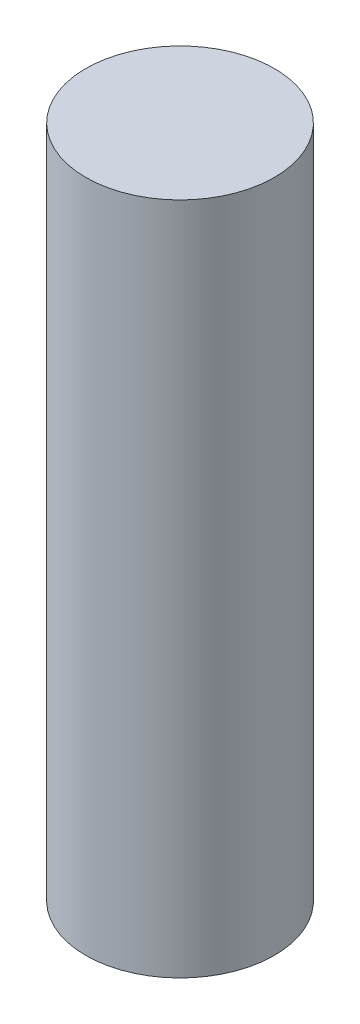
ISO-10303-21;
HEADER;
FILE_DESCRIPTION(('STEP AP214'),'2;1');
FILE_NAME('part.step','',(''),(''),'','','');
FILE_SCHEMA(('AUTOMOTIVE_DESIGN { 1 0 10303 214 1 1 1 1 }'));
ENDSEC;
DATA;
#1=APPLICATION_CONTEXT('core data for automotive mechanical design processes');
#2=APPLICATION_PROTOCOL_DEFINITION('international standard','automotive_design',2000,#1);
#3=PRODUCT_CONTEXT('',#1,'mechanical');
#4=PRODUCT('Part','Part','',(#3));
#5=PRODUCT_RELATED_PRODUCT_CATEGORY('part','',(#4));
#6=PRODUCT_DEFINITION_FORMATION('','',#4);
#7=PRODUCT_DEFINITION_CONTEXT('part definition',#1,'design');
#8=PRODUCT_DEFINITION('design','',#6,#7);
#9=PRODUCT_DEFINITION_SHAPE('','',#8);
#10=(LENGTH_UNIT() NAMED_UNIT(*) SI_UNIT(.MILLI.,.METRE.));
#11=(NAMED_UNIT(*) PLANE_ANGLE_UNIT() SI_UNIT($,.RADIAN.));
#12=(NAMED_UNIT(*) SI_UNIT($,.STERADIAN.) SOLID_ANGLE_UNIT());
#13=UNCERTAINTY_MEASURE_WITH_UNIT(LENGTH_MEASURE(1.E-05),#10,'distance_accuracy_value','');
#14=(GEOMETRIC_REPRESENTATION_CONTEXT(3) GLOBAL_UNCERTAINTY_ASSIGNED_CONTEXT((#13)) GLOBAL_UNIT_ASSIGNED_CONTEXT((#10,
#11,#12)) REPRESENTATION_CONTEXT('',''));
#15=CARTESIAN_POINT('',(0.,0.,0.));
#16=DIRECTION('',(0.,0.,1.));
#17=DIRECTION('',(1.,0.,0.));
#18=AXIS2_PLACEMENT_3D('',#15,#16,#17);
#19=CARTESIAN_POINT('',(0.,37.5,0.));
#20=DIRECTION('',(0.,-1.,0.));
#21=DIRECTION('',(0.,0.,-1.));
#22=AXIS2_PLACEMENT_3D('',#19,#20,#21);
#23=CYLINDRICAL_SURFACE('',#22,10.5);
#24=CARTESIAN_POINT('',(0.,37.5,0.));
#25=DIRECTION('',(0.,1.,0.));
#26=DIRECTION('',(0.,0.,1.));
#27=AXIS2_PLACEMENT_3D('',#24,#25,#26);
#28=CIRCLE('',#27,10.5);
#29=CARTESIAN_POINT('',(0.,37.5,10.5));
#30=VERTEX_POINT('',#29);
#31=EDGE_CURVE('E10',#30,#30,#28,.T.);
#32=ORIENTED_EDGE('',*,*,#31,.F.);
#33=EDGE_LOOP('',(#32));
#34=FACE_BOUND('',#33,.T.);
#35=CARTESIAN_POINT('',(0.,-37.5,0.));
#36=DIRECTION('',(0.,1.,0.));
#37=DIRECTION('',(0.,0.,1.));
#38=AXIS2_PLACEMENT_3D('',#35,#36,#37);
#39=CIRCLE('',#38,10.5);
#40=CARTESIAN_POINT('',(0.,-37.5,10.5));
#41=VERTEX_POINT('',#40);
#42=EDGE_CURVE('E34',#41,#41,#39,.T.);
#43=ORIENTED_EDGE('',*,*,#42,.T.);
#44=EDGE_LOOP('',(#43));
#45=FACE_BOUND('',#44,.T.);
#46=ADVANCED_FACE('F31',(#34,#45),#23,.T.);
#47=CARTESIAN_POINT('',(0.,37.5,0.));
#48=DIRECTION('',(0.,1.,0.));
#49=DIRECTION('',(0.,0.,1.));
#50=AXIS2_PLACEMENT_3D('',#47,#48,#49);
#51=PLANE('',#50);
#52=ORIENTED_EDGE('',*,*,#31,.T.);
#53=EDGE_LOOP('',(#52));
#54=FACE_BOUND('',#53,.T.);
#55=ADVANCED_FACE('F46',(#54),#51,.T.);
#56=CARTESIAN_POINT('',(0.,-37.5,0.));
#57=DIRECTION('',(0.,1.,0.));
#58=DIRECTION('',(0.,0.,1.));
#59=AXIS2_PLACEMENT_3D('',#56,#57,#58);
#60=PLANE('',#59);
#61=ORIENTED_EDGE('',*,*,#42,.F.);
#62=EDGE_LOOP('',(#61));
#63=FACE_BOUND('',#62,.T.);
#64=ADVANCED_FACE('F44',(#63),#60,.F.);
#65=CLOSED_SHELL('',(#46,#55,#64));
#66=MANIFOLD_SOLID_BREP('B2',#65);
#67=ADVANCED_BREP_SHAPE_REPRESENTATION('',(#18,#66),#14);
#68=SHAPE_DEFINITION_REPRESENTATION(#9,#67);
ENDSEC;
END-ISO-10303-21;
